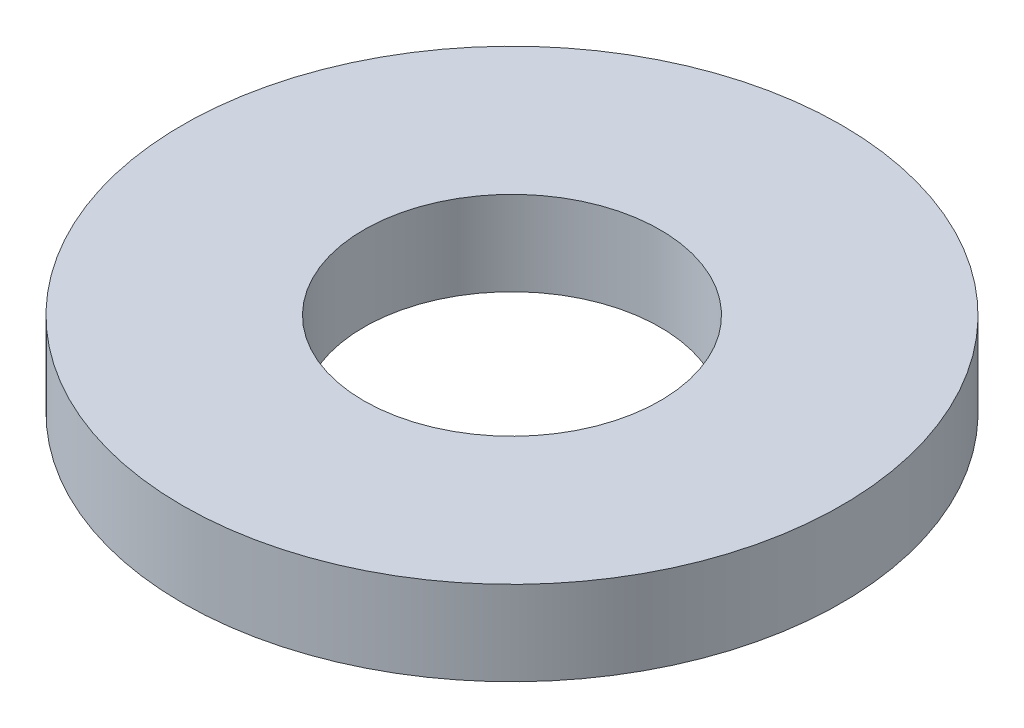
ISO-10303-21;
HEADER;
FILE_DESCRIPTION(('STEP AP214'),'2;1');
FILE_NAME('part.step','',(''),(''),'','','');
FILE_SCHEMA(('AUTOMOTIVE_DESIGN { 1 0 10303 214 1 1 1 1 }'));
ENDSEC;
DATA;
#1=APPLICATION_CONTEXT('core data for automotive mechanical design processes');
#2=APPLICATION_PROTOCOL_DEFINITION('international standard','automotive_design',2000,#1);
#3=PRODUCT_CONTEXT('',#1,'mechanical');
#4=PRODUCT('Part','Part','',(#3));
#5=PRODUCT_RELATED_PRODUCT_CATEGORY('part','',(#4));
#6=PRODUCT_DEFINITION_FORMATION('','',#4);
#7=PRODUCT_DEFINITION_CONTEXT('part definition',#1,'design');
#8=PRODUCT_DEFINITION('design','',#6,#7);
#9=PRODUCT_DEFINITION_SHAPE('','',#8);
#10=(LENGTH_UNIT() NAMED_UNIT(*) SI_UNIT(.MILLI.,.METRE.));
#11=(NAMED_UNIT(*) PLANE_ANGLE_UNIT() SI_UNIT($,.RADIAN.));
#12=(NAMED_UNIT(*) SI_UNIT($,.STERADIAN.) SOLID_ANGLE_UNIT());
#13=UNCERTAINTY_MEASURE_WITH_UNIT(LENGTH_MEASURE(1.E-05),#10,'distance_accuracy_value','');
#14=(GEOMETRIC_REPRESENTATION_CONTEXT(3) GLOBAL_UNCERTAINTY_ASSIGNED_CONTEXT((#13)) GLOBAL_UNIT_ASSIGNED_CONTEXT((#10,
#11,#12)) REPRESENTATION_CONTEXT('',''));
#15=CARTESIAN_POINT('',(0.,0.,0.));
#16=DIRECTION('',(0.,0.,1.));
#17=DIRECTION('',(1.,0.,0.));
#18=AXIS2_PLACEMENT_3D('',#15,#16,#17);
#19=CARTESIAN_POINT('',(0.,2.032,0.));
#20=DIRECTION('',(0.,-1.,0.));
#21=DIRECTION('',(0.,0.,-1.));
#22=AXIS2_PLACEMENT_3D('',#19,#20,#21);
#23=CYLINDRICAL_SURFACE('',#22,7.9375);
#24=CARTESIAN_POINT('',(0.,2.032,0.));
#25=DIRECTION('',(0.,1.,0.));
#26=DIRECTION('',(0.,0.,1.));
#27=AXIS2_PLACEMENT_3D('',#24,#25,#26);
#28=CIRCLE('',#27,7.9375);
#29=CARTESIAN_POINT('',(0.,2.032,7.9375));
#30=VERTEX_POINT('',#29);
#31=EDGE_CURVE('E10',#30,#30,#28,.T.);
#32=ORIENTED_EDGE('',*,*,#31,.F.);
#33=EDGE_LOOP('',(#32));
#34=FACE_BOUND('',#33,.T.);
#35=CARTESIAN_POINT('',(0.,0.,0.));
#36=DIRECTION('',(0.,1.,0.));
#37=DIRECTION('',(0.,0.,1.));
#38=AXIS2_PLACEMENT_3D('',#35,#36,#37);
#39=CIRCLE('',#38,7.9375);
#40=CARTESIAN_POINT('',(0.,0.,7.9375));
#41=VERTEX_POINT('',#40);
#42=EDGE_CURVE('E38',#41,#41,#39,.T.);
#43=ORIENTED_EDGE('',*,*,#42,.T.);
#44=EDGE_LOOP('',(#43));
#45=FACE_BOUND('',#44,.T.);
#46=ADVANCED_FACE('F35',(#34,#45),#23,.T.);
#47=CARTESIAN_POINT('',(0.,2.032,0.));
#48=DIRECTION('',(0.,1.,0.));
#49=DIRECTION('',(0.,0.,1.));
#50=AXIS2_PLACEMENT_3D('',#47,#48,#49);
#51=PLANE('',#50);
#52=CARTESIAN_POINT('',(0.,2.032,0.));
#53=DIRECTION('',(0.,1.,0.));
#54=DIRECTION('',(0.,0.,1.));
#55=AXIS2_PLACEMENT_3D('',#52,#53,#54);
#56=CIRCLE('',#55,3.5687);
#57=CARTESIAN_POINT('',(0.,2.032,3.5687));
#58=VERTEX_POINT('',#57);
#59=EDGE_CURVE('E47',#58,#58,#56,.T.);
#60=ORIENTED_EDGE('',*,*,#59,.F.);
#61=EDGE_LOOP('',(#60));
#62=FACE_BOUND('',#61,.T.);
#63=ORIENTED_EDGE('',*,*,#31,.T.);
#64=EDGE_LOOP('',(#63));
#65=FACE_BOUND('',#64,.T.);
#66=ADVANCED_FACE('F62',(#62,#65),#51,.T.);
#67=CARTESIAN_POINT('',(0.,0.,0.));
#68=DIRECTION('',(0.,1.,0.));
#69=DIRECTION('',(0.,0.,1.));
#70=AXIS2_PLACEMENT_3D('',#67,#68,#69);
#71=PLANE('',#70);
#72=CARTESIAN_POINT('',(0.,0.,0.));
#73=DIRECTION('',(0.,1.,0.));
#74=DIRECTION('',(0.,0.,1.));
#75=AXIS2_PLACEMENT_3D('',#72,#73,#74);
#76=CIRCLE('',#75,3.5687);
#77=CARTESIAN_POINT('',(0.,0.,3.5687));
#78=VERTEX_POINT('',#77);
#79=EDGE_CURVE('E45',#78,#78,#76,.T.);
#80=ORIENTED_EDGE('',*,*,#79,.T.);
#81=EDGE_LOOP('',(#80));
#82=FACE_BOUND('',#81,.T.);
#83=ORIENTED_EDGE('',*,*,#42,.F.);
#84=EDGE_LOOP('',(#83));
#85=FACE_BOUND('',#84,.T.);
#86=ADVANCED_FACE('F53',(#82,#85),#71,.F.);
#87=CARTESIAN_POINT('',(0.,0.,0.));
#88=DIRECTION('',(0.,1.,0.));
#89=DIRECTION('',(0.,0.,1.));
#90=AXIS2_PLACEMENT_3D('',#87,#88,#89);
#91=CYLINDRICAL_SURFACE('',#90,3.5687);
#92=ORIENTED_EDGE('',*,*,#79,.F.);
#93=EDGE_LOOP('',(#92));
#94=FACE_BOUND('',#93,.T.);
#95=ORIENTED_EDGE('',*,*,#59,.T.);
#96=EDGE_LOOP('',(#95));
#97=FACE_BOUND('',#96,.T.);
#98=ADVANCED_FACE('F56',(#94,#97),#91,.F.);
#99=CLOSED_SHELL('',(#46,#66,#86,#98));
#100=MANIFOLD_SOLID_BREP('B2',#99);
#101=ADVANCED_BREP_SHAPE_REPRESENTATION('',(#18,#100),#14);
#102=SHAPE_DEFINITION_REPRESENTATION(#9,#101);
ENDSEC;
END-ISO-10303-21;
